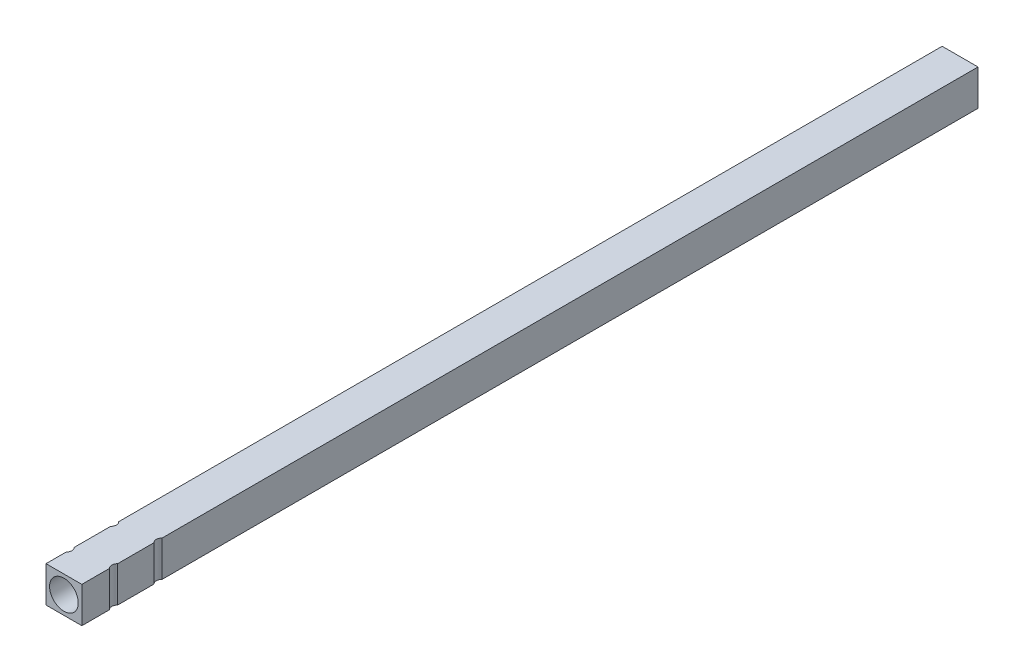
ISO-10303-21;
HEADER;
FILE_DESCRIPTION(('STEP AP214'),'2;1');
FILE_NAME('part.step','',(''),(''),'','','');
FILE_SCHEMA(('AUTOMOTIVE_DESIGN { 1 0 10303 214 1 1 1 1 }'));
ENDSEC;
DATA;
#1=APPLICATION_CONTEXT('core data for automotive mechanical design processes');
#2=APPLICATION_PROTOCOL_DEFINITION('international standard','automotive_design',2000,#1);
#3=PRODUCT_CONTEXT('',#1,'mechanical');
#4=PRODUCT('Part','Part','',(#3));
#5=PRODUCT_RELATED_PRODUCT_CATEGORY('part','',(#4));
#6=PRODUCT_DEFINITION_FORMATION('','',#4);
#7=PRODUCT_DEFINITION_CONTEXT('part definition',#1,'design');
#8=PRODUCT_DEFINITION('design','',#6,#7);
#9=PRODUCT_DEFINITION_SHAPE('','',#8);
#10=(LENGTH_UNIT() NAMED_UNIT(*) SI_UNIT(.MILLI.,.METRE.));
#11=(NAMED_UNIT(*) PLANE_ANGLE_UNIT() SI_UNIT($,.RADIAN.));
#12=(NAMED_UNIT(*) SI_UNIT($,.STERADIAN.) SOLID_ANGLE_UNIT());
#13=UNCERTAINTY_MEASURE_WITH_UNIT(LENGTH_MEASURE(1.E-05),#10,'distance_accuracy_value','');
#14=(GEOMETRIC_REPRESENTATION_CONTEXT(3) GLOBAL_UNCERTAINTY_ASSIGNED_CONTEXT((#13)) GLOBAL_UNIT_ASSIGNED_CONTEXT((#10,
#11,#12)) REPRESENTATION_CONTEXT('',''));
#15=CARTESIAN_POINT('',(0.,0.,0.));
#16=DIRECTION('',(0.,0.,1.));
#17=DIRECTION('',(1.,0.,0.));
#18=AXIS2_PLACEMENT_3D('',#15,#16,#17);
#19=CARTESIAN_POINT('',(5.,5.,250.));
#20=DIRECTION('',(-1.,0.,0.));
#21=DIRECTION('',(0.,0.,1.));
#22=AXIS2_PLACEMENT_3D('',#19,#20,#21);
#23=PLANE('',#22);
#24=DIRECTION('',(0.,0.,-1.));
#25=VECTOR('',#24,1.);
#26=CARTESIAN_POINT('',(5.,5.,250.));
#27=LINE('',#26,#25);
#28=CARTESIAN_POINT('',(5.,5.,240.009761504417));
#29=VERTEX_POINT('',#28);
#30=CARTESIAN_POINT('',(5.00000000000001,5.,229.876668079733));
#31=VERTEX_POINT('',#30);
#32=EDGE_CURVE('E142',#29,#31,#27,.T.);
#33=ORIENTED_EDGE('',*,*,#32,.F.);
#34=DIRECTION('',(0.,-1.,0.));
#35=VECTOR('',#34,1.);
#36=CARTESIAN_POINT('',(5.,5.,240.009761504417));
#37=LINE('',#36,#35);
#38=CARTESIAN_POINT('',(5.,-5.,240.009761504417));
#39=VERTEX_POINT('',#38);
#40=EDGE_CURVE('E48',#29,#39,#37,.T.);
#41=ORIENTED_EDGE('',*,*,#40,.T.);
#42=DIRECTION('',(0.,0.,-1.));
#43=VECTOR('',#42,1.);
#44=CARTESIAN_POINT('',(5.,-5.,250.));
#45=LINE('',#44,#43);
#46=CARTESIAN_POINT('',(5.,-5.,229.876668079733));
#47=VERTEX_POINT('',#46);
#48=EDGE_CURVE('E145',#39,#47,#45,.T.);
#49=ORIENTED_EDGE('',*,*,#48,.T.);
#50=DIRECTION('',(0.,-1.,0.));
#51=VECTOR('',#50,1.);
#52=CARTESIAN_POINT('',(5.,5.,229.876668079733));
#53=LINE('',#52,#51);
#54=EDGE_CURVE('E210',#47,#31,#53,.F.);
#55=ORIENTED_EDGE('',*,*,#54,.T.);
#56=EDGE_LOOP('',(#33,#41,#49,#55));
#57=FACE_BOUND('',#56,.T.);
#58=ADVANCED_FACE('F33',(#57),#23,.F.);
#59=CARTESIAN_POINT('',(-5.,5.,250.));
#60=DIRECTION('',(1.,0.,0.));
#61=DIRECTION('',(0.,0.,-1.));
#62=AXIS2_PLACEMENT_3D('',#59,#60,#61);
#63=PLANE('',#62);
#64=DIRECTION('',(0.,0.,-1.));
#65=VECTOR('',#64,1.);
#66=CARTESIAN_POINT('',(-5.,5.,250.));
#67=LINE('',#66,#65);
#68=CARTESIAN_POINT('',(-5.,5.,242.123331920267));
#69=VERTEX_POINT('',#68);
#70=CARTESIAN_POINT('',(-5.,5.,231.990238495583));
#71=VERTEX_POINT('',#70);
#72=EDGE_CURVE('E154',#69,#71,#67,.T.);
#73=ORIENTED_EDGE('',*,*,#72,.T.);
#74=DIRECTION('',(0.,-1.,0.));
#75=VECTOR('',#74,1.);
#76=CARTESIAN_POINT('',(-5.,5.,231.990238495583));
#77=LINE('',#76,#75);
#78=CARTESIAN_POINT('',(-5.,-5.,231.990238495583));
#79=VERTEX_POINT('',#78);
#80=EDGE_CURVE('E11',#71,#79,#77,.T.);
#81=ORIENTED_EDGE('',*,*,#80,.T.);
#82=DIRECTION('',(0.,0.,-1.));
#83=VECTOR('',#82,1.);
#84=CARTESIAN_POINT('',(-5.,-5.,250.));
#85=LINE('',#84,#83);
#86=CARTESIAN_POINT('',(-5.,-5.,242.123331920267));
#87=VERTEX_POINT('',#86);
#88=EDGE_CURVE('E166',#87,#79,#85,.T.);
#89=ORIENTED_EDGE('',*,*,#88,.F.);
#90=DIRECTION('',(0.,-1.,0.));
#91=VECTOR('',#90,1.);
#92=CARTESIAN_POINT('',(-5.,5.,242.123331920267));
#93=LINE('',#92,#91);
#94=EDGE_CURVE('E226',#87,#69,#93,.F.);
#95=ORIENTED_EDGE('',*,*,#94,.T.);
#96=EDGE_LOOP('',(#73,#81,#89,#95));
#97=FACE_BOUND('',#96,.T.);
#98=ADVANCED_FACE('F256',(#97),#63,.F.);
#99=CARTESIAN_POINT('',(5.,5.,227.590019156043));
#100=VERTEX_POINT('',#99);
#101=CARTESIAN_POINT('',(5.,5.,0.));
#102=VERTEX_POINT('',#101);
#103=EDGE_CURVE('E144',#100,#102,#27,.T.);
#104=ORIENTED_EDGE('',*,*,#103,.F.);
#105=DIRECTION('',(0.,-1.,0.));
#106=VECTOR('',#105,1.);
#107=CARTESIAN_POINT('',(5.,5.,227.590019156043));
#108=LINE('',#107,#106);
#109=CARTESIAN_POINT('',(5.,-5.,227.590019156043));
#110=VERTEX_POINT('',#109);
#111=EDGE_CURVE('E205',#100,#110,#108,.T.);
#112=ORIENTED_EDGE('',*,*,#111,.T.);
#113=CARTESIAN_POINT('',(5.,-5.,0.));
#114=VERTEX_POINT('',#113);
#115=EDGE_CURVE('E141',#110,#114,#45,.T.);
#116=ORIENTED_EDGE('',*,*,#115,.T.);
#117=DIRECTION('',(0.,1.,0.));
#118=VECTOR('',#117,1.);
#119=CARTESIAN_POINT('',(5.,5.,0.));
#120=LINE('',#119,#118);
#121=EDGE_CURVE('E187',#114,#102,#120,.T.);
#122=ORIENTED_EDGE('',*,*,#121,.T.);
#123=EDGE_LOOP('',(#104,#112,#116,#122));
#124=FACE_BOUND('',#123,.T.);
#125=ADVANCED_FACE('F239',(#124),#23,.F.);
#126=CARTESIAN_POINT('',(-5.,5.,250.));
#127=VERTEX_POINT('',#126);
#128=CARTESIAN_POINT('',(-5.,5.,244.409980843957));
#129=VERTEX_POINT('',#128);
#130=EDGE_CURVE('E148',#127,#129,#67,.T.);
#131=ORIENTED_EDGE('',*,*,#130,.T.);
#132=DIRECTION('',(0.,-1.,0.));
#133=VECTOR('',#132,1.);
#134=CARTESIAN_POINT('',(-5.,5.,244.409980843957));
#135=LINE('',#134,#133);
#136=CARTESIAN_POINT('',(-5.,-5.,244.409980843957));
#137=VERTEX_POINT('',#136);
#138=EDGE_CURVE('E230',#129,#137,#135,.T.);
#139=ORIENTED_EDGE('',*,*,#138,.T.);
#140=CARTESIAN_POINT('',(-5.,-5.,250.));
#141=VERTEX_POINT('',#140);
#142=EDGE_CURVE('E161',#141,#137,#85,.T.);
#143=ORIENTED_EDGE('',*,*,#142,.F.);
#144=DIRECTION('',(0.,-1.,0.));
#145=VECTOR('',#144,1.);
#146=CARTESIAN_POINT('',(-5.,5.,250.));
#147=LINE('',#146,#145);
#148=EDGE_CURVE('E174',#127,#141,#147,.T.);
#149=ORIENTED_EDGE('',*,*,#148,.F.);
#150=EDGE_LOOP('',(#131,#139,#143,#149));
#151=FACE_BOUND('',#150,.T.);
#152=ADVANCED_FACE('F263',(#151),#63,.F.);
#153=CARTESIAN_POINT('',(0.,0.,250.));
#154=DIRECTION('',(0.,0.,-1.));
#155=DIRECTION('',(-1.,0.,0.));
#156=AXIS2_PLACEMENT_3D('',#153,#154,#155);
#157=PLANE('',#156);
#158=DIRECTION('',(1.,0.,0.));
#159=VECTOR('',#158,1.);
#160=CARTESIAN_POINT('',(-5.,-5.,250.));
#161=LINE('',#160,#159);
#162=CARTESIAN_POINT('',(5.,-5.,250.));
#163=VERTEX_POINT('',#162);
#164=EDGE_CURVE('E192',#141,#163,#161,.T.);
#165=ORIENTED_EDGE('',*,*,#164,.T.);
#166=DIRECTION('',(0.,1.,0.));
#167=VECTOR('',#166,1.);
#168=CARTESIAN_POINT('',(5.,5.,250.));
#169=LINE('',#168,#167);
#170=CARTESIAN_POINT('',(5.,5.,250.));
#171=VERTEX_POINT('',#170);
#172=EDGE_CURVE('E181',#163,#171,#169,.T.);
#173=ORIENTED_EDGE('',*,*,#172,.T.);
#174=DIRECTION('',(-1.,0.,0.));
#175=VECTOR('',#174,1.);
#176=CARTESIAN_POINT('',(-5.,5.,250.));
#177=LINE('',#176,#175);
#178=EDGE_CURVE('E140',#171,#127,#177,.T.);
#179=ORIENTED_EDGE('',*,*,#178,.T.);
#180=ORIENTED_EDGE('',*,*,#148,.T.);
#181=EDGE_LOOP('',(#165,#173,#179,#180));
#182=FACE_BOUND('',#181,.T.);
#183=CARTESIAN_POINT('',(0.,0.,250.));
#184=DIRECTION('',(0.,0.,1.));
#185=DIRECTION('',(1.,0.,0.));
#186=AXIS2_PLACEMENT_3D('',#183,#184,#185);
#187=CIRCLE('',#186,4.);
#188=CARTESIAN_POINT('',(4.,0.,250.));
#189=VERTEX_POINT('',#188);
#190=EDGE_CURVE('E188',#189,#189,#187,.T.);
#191=ORIENTED_EDGE('',*,*,#190,.F.);
#192=EDGE_LOOP('',(#191));
#193=FACE_BOUND('',#192,.T.);
#194=ADVANCED_FACE('F275',(#182,#193),#157,.F.);
#195=CARTESIAN_POINT('',(0.,0.,0.));
#196=DIRECTION('',(0.,0.,-1.));
#197=DIRECTION('',(-1.,0.,0.));
#198=AXIS2_PLACEMENT_3D('',#195,#196,#197);
#199=PLANE('',#198);
#200=DIRECTION('',(1.,0.,0.));
#201=VECTOR('',#200,1.);
#202=CARTESIAN_POINT('',(-5.,-5.,0.));
#203=LINE('',#202,#201);
#204=CARTESIAN_POINT('',(-5.,-5.,0.));
#205=VERTEX_POINT('',#204);
#206=EDGE_CURVE('E185',#205,#114,#203,.T.);
#207=ORIENTED_EDGE('',*,*,#206,.F.);
#208=DIRECTION('',(0.,-1.,0.));
#209=VECTOR('',#208,1.);
#210=CARTESIAN_POINT('',(-5.,5.,0.));
#211=LINE('',#210,#209);
#212=CARTESIAN_POINT('',(-5.,5.,0.));
#213=VERTEX_POINT('',#212);
#214=EDGE_CURVE('E191',#213,#205,#211,.T.);
#215=ORIENTED_EDGE('',*,*,#214,.F.);
#216=DIRECTION('',(-1.,0.,0.));
#217=VECTOR('',#216,1.);
#218=CARTESIAN_POINT('',(-5.,5.,0.));
#219=LINE('',#218,#217);
#220=EDGE_CURVE('E190',#102,#213,#219,.T.);
#221=ORIENTED_EDGE('',*,*,#220,.F.);
#222=ORIENTED_EDGE('',*,*,#121,.F.);
#223=EDGE_LOOP('',(#207,#215,#221,#222));
#224=FACE_BOUND('',#223,.T.);
#225=CARTESIAN_POINT('',(0.,0.,0.));
#226=DIRECTION('',(0.,0.,1.));
#227=DIRECTION('',(1.,0.,0.));
#228=AXIS2_PLACEMENT_3D('',#225,#226,#227);
#229=CIRCLE('',#228,4.);
#230=CARTESIAN_POINT('',(4.,0.,0.));
#231=VERTEX_POINT('',#230);
#232=EDGE_CURVE('E197',#231,#231,#229,.T.);
#233=ORIENTED_EDGE('',*,*,#232,.T.);
#234=EDGE_LOOP('',(#233));
#235=FACE_BOUND('',#234,.T.);
#236=ADVANCED_FACE('F236',(#224,#235),#199,.T.);
#237=CARTESIAN_POINT('',(-5.,-5.,250.));
#238=DIRECTION('',(0.,1.,0.));
#239=DIRECTION('',(0.,0.,1.));
#240=AXIS2_PLACEMENT_3D('',#237,#238,#239);
#241=PLANE('',#240);
#242=ORIENTED_EDGE('',*,*,#48,.F.);
#243=CARTESIAN_POINT('',(6.1192895849364,-5.,241.153085966262));
#244=DIRECTION('',(0.,-1.,0.));
#245=DIRECTION('',(0.,0.,-1.));
#246=AXIS2_PLACEMENT_3D('',#243,#244,#245);
#247=CIRCLE('',#246,1.59999999999999);
#248=CARTESIAN_POINT('',(5.,-5.,242.296410428107));
#249=VERTEX_POINT('',#248);
#250=EDGE_CURVE('E127',#249,#39,#247,.T.);
#251=ORIENTED_EDGE('',*,*,#250,.F.);
#252=EDGE_CURVE('E136',#163,#249,#45,.T.);
#253=ORIENTED_EDGE('',*,*,#252,.F.);
#254=ORIENTED_EDGE('',*,*,#164,.F.);
#255=ORIENTED_EDGE('',*,*,#142,.T.);
#256=CARTESIAN_POINT('',(-6.1192895849364,-5.,243.266656382112));
#257=DIRECTION('',(0.,-1.,0.));
#258=DIRECTION('',(0.,0.,-1.));
#259=AXIS2_PLACEMENT_3D('',#256,#257,#258);
#260=CIRCLE('',#259,1.59999999999999);
#261=EDGE_CURVE('E203',#87,#137,#260,.T.);
#262=ORIENTED_EDGE('',*,*,#261,.F.);
#263=ORIENTED_EDGE('',*,*,#88,.T.);
#264=CARTESIAN_POINT('',(-6.11928958493642,-5.,230.846914033738));
#265=DIRECTION('',(0.,-1.,0.));
#266=DIRECTION('',(0.,0.,-1.));
#267=AXIS2_PLACEMENT_3D('',#264,#265,#266);
#268=CIRCLE('',#267,1.59999999999999);
#269=CARTESIAN_POINT('',(-5.,-5.,229.703589571893));
#270=VERTEX_POINT('',#269);
#271=EDGE_CURVE('E217',#270,#79,#268,.T.);
#272=ORIENTED_EDGE('',*,*,#271,.F.);
#273=EDGE_CURVE('E167',#270,#205,#85,.T.);
#274=ORIENTED_EDGE('',*,*,#273,.T.);
#275=ORIENTED_EDGE('',*,*,#206,.T.);
#276=ORIENTED_EDGE('',*,*,#115,.F.);
#277=CARTESIAN_POINT('',(6.11928958493641,-5.,228.733343617888));
#278=DIRECTION('',(0.,-1.,0.));
#279=DIRECTION('',(0.,0.,-1.));
#280=AXIS2_PLACEMENT_3D('',#277,#278,#279);
#281=CIRCLE('',#280,1.59999999999999);
#282=EDGE_CURVE('E214',#47,#110,#281,.T.);
#283=ORIENTED_EDGE('',*,*,#282,.F.);
#284=EDGE_LOOP('',(#242,#251,#253,#254,#255,#262,#263,#272,#274,#275,#276,#283));
#285=FACE_BOUND('',#284,.T.);
#286=ADVANCED_FACE('F35',(#285),#241,.F.);
#287=ORIENTED_EDGE('',*,*,#252,.T.);
#288=DIRECTION('',(0.,-1.,0.));
#289=VECTOR('',#288,1.);
#290=CARTESIAN_POINT('',(5.,5.,242.296410428107));
#291=LINE('',#290,#289);
#292=CARTESIAN_POINT('',(5.,5.,242.296410428107));
#293=VERTEX_POINT('',#292);
#294=EDGE_CURVE('E122',#249,#293,#291,.F.);
#295=ORIENTED_EDGE('',*,*,#294,.T.);
#296=EDGE_CURVE('E133',#171,#293,#27,.T.);
#297=ORIENTED_EDGE('',*,*,#296,.F.);
#298=ORIENTED_EDGE('',*,*,#172,.F.);
#299=EDGE_LOOP('',(#287,#295,#297,#298));
#300=FACE_BOUND('',#299,.T.);
#301=ADVANCED_FACE('F132',(#300),#23,.F.);
#302=CARTESIAN_POINT('',(-5.,5.,250.));
#303=DIRECTION('',(0.,-1.,0.));
#304=DIRECTION('',(0.,0.,-1.));
#305=AXIS2_PLACEMENT_3D('',#302,#303,#304);
#306=PLANE('',#305);
#307=ORIENTED_EDGE('',*,*,#296,.T.);
#308=CARTESIAN_POINT('',(6.1192895849364,5.,241.153085966262));
#309=DIRECTION('',(0.,-1.,0.));
#310=DIRECTION('',(0.,0.,-1.));
#311=AXIS2_PLACEMENT_3D('',#308,#309,#310);
#312=CIRCLE('',#311,1.59999999999999);
#313=EDGE_CURVE('E119',#293,#29,#312,.T.);
#314=ORIENTED_EDGE('',*,*,#313,.T.);
#315=ORIENTED_EDGE('',*,*,#32,.T.);
#316=CARTESIAN_POINT('',(6.11928958493641,5.,228.733343617888));
#317=DIRECTION('',(0.,-1.,0.));
#318=DIRECTION('',(0.,0.,-1.));
#319=AXIS2_PLACEMENT_3D('',#316,#317,#318);
#320=CIRCLE('',#319,1.59999999999999);
#321=EDGE_CURVE('E213',#31,#100,#320,.T.);
#322=ORIENTED_EDGE('',*,*,#321,.T.);
#323=ORIENTED_EDGE('',*,*,#103,.T.);
#324=ORIENTED_EDGE('',*,*,#220,.T.);
#325=CARTESIAN_POINT('',(-5.,5.,229.703589571893));
#326=VERTEX_POINT('',#325);
#327=EDGE_CURVE('E155',#326,#213,#67,.T.);
#328=ORIENTED_EDGE('',*,*,#327,.F.);
#329=CARTESIAN_POINT('',(-6.11928958493642,5.,230.846914033738));
#330=DIRECTION('',(0.,-1.,0.));
#331=DIRECTION('',(0.,0.,-1.));
#332=AXIS2_PLACEMENT_3D('',#329,#330,#331);
#333=CIRCLE('',#332,1.59999999999999);
#334=EDGE_CURVE('E56',#326,#71,#333,.T.);
#335=ORIENTED_EDGE('',*,*,#334,.T.);
#336=ORIENTED_EDGE('',*,*,#72,.F.);
#337=CARTESIAN_POINT('',(-6.1192895849364,5.,243.266656382112));
#338=DIRECTION('',(0.,-1.,0.));
#339=DIRECTION('',(0.,0.,-1.));
#340=AXIS2_PLACEMENT_3D('',#337,#338,#339);
#341=CIRCLE('',#340,1.59999999999999);
#342=EDGE_CURVE('E200',#69,#129,#341,.T.);
#343=ORIENTED_EDGE('',*,*,#342,.T.);
#344=ORIENTED_EDGE('',*,*,#130,.F.);
#345=ORIENTED_EDGE('',*,*,#178,.F.);
#346=EDGE_LOOP('',(#307,#314,#315,#322,#323,#324,#328,#335,#336,#343,#344,#345));
#347=FACE_BOUND('',#346,.T.);
#348=ADVANCED_FACE('F138',(#347),#306,.F.);
#349=ORIENTED_EDGE('',*,*,#273,.F.);
#350=DIRECTION('',(0.,-1.,0.));
#351=VECTOR('',#350,1.);
#352=CARTESIAN_POINT('',(-5.,5.,229.703589571893));
#353=LINE('',#352,#351);
#354=EDGE_CURVE('E41',#270,#326,#353,.F.);
#355=ORIENTED_EDGE('',*,*,#354,.T.);
#356=ORIENTED_EDGE('',*,*,#327,.T.);
#357=ORIENTED_EDGE('',*,*,#214,.T.);
#358=EDGE_LOOP('',(#349,#355,#356,#357));
#359=FACE_BOUND('',#358,.T.);
#360=ADVANCED_FACE('F231',(#359),#63,.F.);
#361=CARTESIAN_POINT('',(0.,0.,250.));
#362=DIRECTION('',(0.,0.,-1.));
#363=DIRECTION('',(-1.,0.,0.));
#364=AXIS2_PLACEMENT_3D('',#361,#362,#363);
#365=CYLINDRICAL_SURFACE('',#364,4.);
#366=ORIENTED_EDGE('',*,*,#190,.T.);
#367=EDGE_LOOP('',(#366));
#368=FACE_BOUND('',#367,.T.);
#369=ORIENTED_EDGE('',*,*,#232,.F.);
#370=EDGE_LOOP('',(#369));
#371=FACE_BOUND('',#370,.T.);
#372=ADVANCED_FACE('F252',(#368,#371),#365,.F.);
#373=CARTESIAN_POINT('',(-6.1192895849364,5.,243.266656382112));
#374=DIRECTION('',(0.,-1.,0.));
#375=DIRECTION('',(0.,0.,-1.));
#376=AXIS2_PLACEMENT_3D('',#373,#374,#375);
#377=CYLINDRICAL_SURFACE('',#376,1.59999999999999);
#378=ORIENTED_EDGE('',*,*,#342,.F.);
#379=ORIENTED_EDGE('',*,*,#94,.F.);
#380=ORIENTED_EDGE('',*,*,#261,.T.);
#381=ORIENTED_EDGE('',*,*,#138,.F.);
#382=EDGE_LOOP('',(#378,#379,#380,#381));
#383=FACE_BOUND('',#382,.T.);
#384=ADVANCED_FACE('F245',(#383),#377,.F.);
#385=CARTESIAN_POINT('',(6.11928958493641,5.,228.733343617888));
#386=DIRECTION('',(0.,-1.,0.));
#387=DIRECTION('',(0.,0.,-1.));
#388=AXIS2_PLACEMENT_3D('',#385,#386,#387);
#389=CYLINDRICAL_SURFACE('',#388,1.59999999999999);
#390=ORIENTED_EDGE('',*,*,#321,.F.);
#391=ORIENTED_EDGE('',*,*,#54,.F.);
#392=ORIENTED_EDGE('',*,*,#282,.T.);
#393=ORIENTED_EDGE('',*,*,#111,.F.);
#394=EDGE_LOOP('',(#390,#391,#392,#393));
#395=FACE_BOUND('',#394,.T.);
#396=ADVANCED_FACE('F242',(#395),#389,.F.);
#397=CARTESIAN_POINT('',(-6.11928958493642,5.,230.846914033738));
#398=DIRECTION('',(0.,-1.,0.));
#399=DIRECTION('',(0.,0.,-1.));
#400=AXIS2_PLACEMENT_3D('',#397,#398,#399);
#401=CYLINDRICAL_SURFACE('',#400,1.59999999999999);
#402=ORIENTED_EDGE('',*,*,#334,.F.);
#403=ORIENTED_EDGE('',*,*,#354,.F.);
#404=ORIENTED_EDGE('',*,*,#271,.T.);
#405=ORIENTED_EDGE('',*,*,#80,.F.);
#406=EDGE_LOOP('',(#402,#403,#404,#405));
#407=FACE_BOUND('',#406,.T.);
#408=ADVANCED_FACE('F244',(#407),#401,.F.);
#409=CARTESIAN_POINT('',(6.1192895849364,5.,241.153085966262));
#410=DIRECTION('',(0.,-1.,0.));
#411=DIRECTION('',(0.,0.,-1.));
#412=AXIS2_PLACEMENT_3D('',#409,#410,#411);
#413=CYLINDRICAL_SURFACE('',#412,1.59999999999999);
#414=ORIENTED_EDGE('',*,*,#313,.F.);
#415=ORIENTED_EDGE('',*,*,#294,.F.);
#416=ORIENTED_EDGE('',*,*,#250,.T.);
#417=ORIENTED_EDGE('',*,*,#40,.F.);
#418=EDGE_LOOP('',(#414,#415,#416,#417));
#419=FACE_BOUND('',#418,.T.);
#420=ADVANCED_FACE('F121',(#419),#413,.F.);
#421=CLOSED_SHELL('',(#58,#98,#125,#152,#194,#236,#286,#301,#348,#360,#372,#384,#396,#408,#420));
#422=MANIFOLD_SOLID_BREP('B2',#421);
#423=ADVANCED_BREP_SHAPE_REPRESENTATION('',(#18,#422),#14);
#424=SHAPE_DEFINITION_REPRESENTATION(#9,#423);
ENDSEC;
END-ISO-10303-21;
